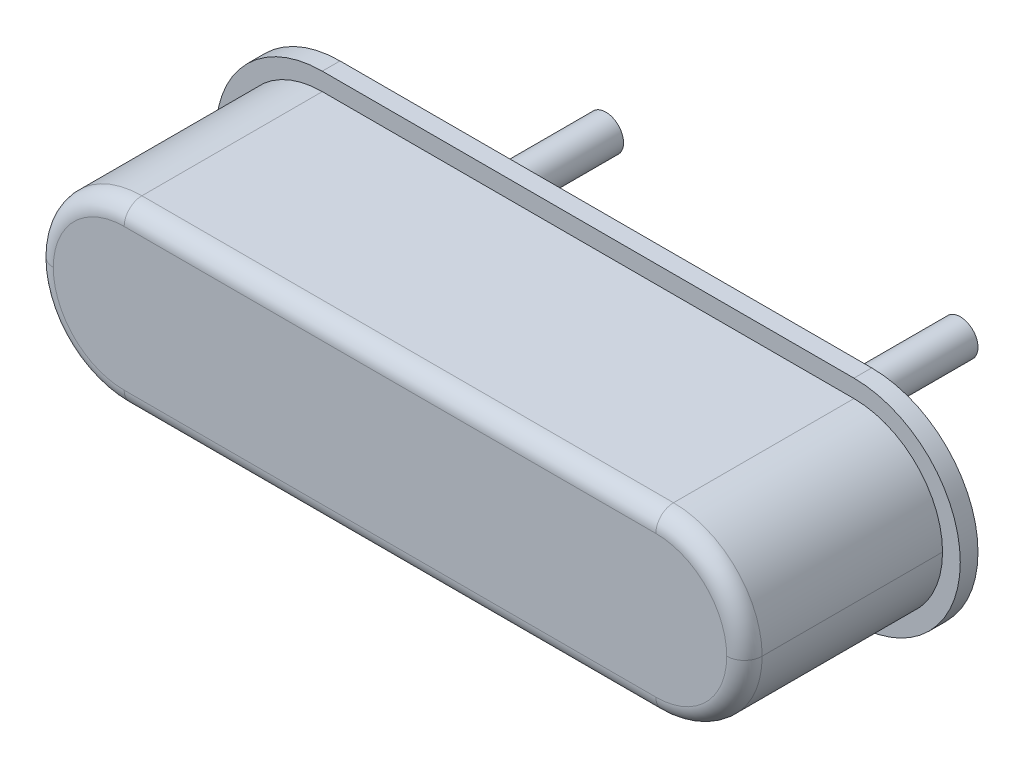
ISO-10303-21;
HEADER;
FILE_DESCRIPTION(('STEP AP214'),'2;1');
FILE_NAME('part.step','',(''),(''),'','','');
FILE_SCHEMA(('AUTOMOTIVE_DESIGN { 1 0 10303 214 1 1 1 1 }'));
ENDSEC;
DATA;
#1=APPLICATION_CONTEXT('core data for automotive mechanical design processes');
#2=APPLICATION_PROTOCOL_DEFINITION('international standard','automotive_design',2000,#1);
#3=PRODUCT_CONTEXT('',#1,'mechanical');
#4=PRODUCT('Part','Part','',(#3));
#5=PRODUCT_RELATED_PRODUCT_CATEGORY('part','',(#4));
#6=PRODUCT_DEFINITION_FORMATION('','',#4);
#7=PRODUCT_DEFINITION_CONTEXT('part definition',#1,'design');
#8=PRODUCT_DEFINITION('design','',#6,#7);
#9=PRODUCT_DEFINITION_SHAPE('','',#8);
#10=(LENGTH_UNIT() NAMED_UNIT(*) SI_UNIT(.MILLI.,.METRE.));
#11=(NAMED_UNIT(*) PLANE_ANGLE_UNIT() SI_UNIT($,.RADIAN.));
#12=(NAMED_UNIT(*) SI_UNIT($,.STERADIAN.) SOLID_ANGLE_UNIT());
#13=UNCERTAINTY_MEASURE_WITH_UNIT(LENGTH_MEASURE(1.E-05),#10,'distance_accuracy_value','');
#14=(GEOMETRIC_REPRESENTATION_CONTEXT(3) GLOBAL_UNCERTAINTY_ASSIGNED_CONTEXT((#13)) GLOBAL_UNIT_ASSIGNED_CONTEXT((#10,
#11,#12)) REPRESENTATION_CONTEXT('',''));
#15=CARTESIAN_POINT('',(0.,0.,0.));
#16=DIRECTION('',(0.,0.,1.));
#17=DIRECTION('',(1.,0.,0.));
#18=AXIS2_PLACEMENT_3D('',#15,#16,#17);
#19=CARTESIAN_POINT('',(-2.54,1.27,0.));
#20=DIRECTION('',(0.,1.,0.));
#21=DIRECTION('',(0.,0.,1.));
#22=AXIS2_PLACEMENT_3D('',#19,#20,#21);
#23=PLANE('',#22);
#24=DIRECTION('',(0.,0.,-1.));
#25=VECTOR('',#24,1.);
#26=CARTESIAN_POINT('',(6.35,1.27,0.));
#27=LINE('',#26,#25);
#28=CARTESIAN_POINT('',(6.35,1.27,2.83961477877701));
#29=VERTEX_POINT('',#28);
#30=CARTESIAN_POINT('',(6.35,1.27,0.254));
#31=VERTEX_POINT('',#30);
#32=EDGE_CURVE('E206',#29,#31,#27,.T.);
#33=ORIENTED_EDGE('',*,*,#32,.T.);
#34=DIRECTION('',(-1.,0.,0.));
#35=VECTOR('',#34,1.);
#36=CARTESIAN_POINT('',(-2.54,1.27,0.254));
#37=LINE('',#36,#35);
#38=CARTESIAN_POINT('',(-1.27,1.27,0.254));
#39=VERTEX_POINT('',#38);
#40=EDGE_CURVE('E178',#31,#39,#37,.T.);
#41=ORIENTED_EDGE('',*,*,#40,.T.);
#42=DIRECTION('',(0.,0.,1.));
#43=VECTOR('',#42,1.);
#44=CARTESIAN_POINT('',(-1.27,1.27,3.09361477877701));
#45=LINE('',#44,#43);
#46=CARTESIAN_POINT('',(-1.27,1.27,2.83961477877701));
#47=VERTEX_POINT('',#46);
#48=EDGE_CURVE('E209',#39,#47,#45,.T.);
#49=ORIENTED_EDGE('',*,*,#48,.T.);
#50=DIRECTION('',(-1.,0.,0.));
#51=VECTOR('',#50,1.);
#52=CARTESIAN_POINT('',(-2.54,1.27,2.83961477877701));
#53=LINE('',#52,#51);
#54=EDGE_CURVE('E228',#47,#29,#53,.F.);
#55=ORIENTED_EDGE('',*,*,#54,.T.);
#56=EDGE_LOOP('',(#33,#41,#49,#55));
#57=FACE_BOUND('',#56,.T.);
#58=ADVANCED_FACE('F37',(#57),#23,.T.);
#59=CARTESIAN_POINT('',(-2.54,-1.27,0.));
#60=DIRECTION('',(0.,1.,0.));
#61=DIRECTION('',(0.,0.,1.));
#62=AXIS2_PLACEMENT_3D('',#59,#60,#61);
#63=PLANE('',#62);
#64=DIRECTION('',(-1.,0.,0.));
#65=VECTOR('',#64,1.);
#66=CARTESIAN_POINT('',(-2.54,-1.27,0.254));
#67=LINE('',#66,#65);
#68=CARTESIAN_POINT('',(6.35,-1.27,0.254));
#69=VERTEX_POINT('',#68);
#70=CARTESIAN_POINT('',(-1.27,-1.27,0.254));
#71=VERTEX_POINT('',#70);
#72=EDGE_CURVE('E176',#69,#71,#67,.T.);
#73=ORIENTED_EDGE('',*,*,#72,.F.);
#74=DIRECTION('',(0.,0.,-1.));
#75=VECTOR('',#74,1.);
#76=CARTESIAN_POINT('',(6.35,-1.27,0.));
#77=LINE('',#76,#75);
#78=CARTESIAN_POINT('',(6.35,-1.27,2.83961477877701));
#79=VERTEX_POINT('',#78);
#80=EDGE_CURVE('E197',#69,#79,#77,.F.);
#81=ORIENTED_EDGE('',*,*,#80,.T.);
#82=DIRECTION('',(-1.,0.,0.));
#83=VECTOR('',#82,1.);
#84=CARTESIAN_POINT('',(-1.27,-1.27,2.83961477877701));
#85=LINE('',#84,#83);
#86=CARTESIAN_POINT('',(-1.27,-1.27,2.83961477877701));
#87=VERTEX_POINT('',#86);
#88=EDGE_CURVE('E237',#79,#87,#85,.T.);
#89=ORIENTED_EDGE('',*,*,#88,.T.);
#90=DIRECTION('',(0.,0.,1.));
#91=VECTOR('',#90,1.);
#92=CARTESIAN_POINT('',(-1.27,-1.27,0.));
#93=LINE('',#92,#91);
#94=EDGE_CURVE('E203',#87,#71,#93,.F.);
#95=ORIENTED_EDGE('',*,*,#94,.T.);
#96=EDGE_LOOP('',(#73,#81,#89,#95));
#97=FACE_BOUND('',#96,.T.);
#98=ADVANCED_FACE('F266',(#97),#63,.F.);
#99=CARTESIAN_POINT('',(-1.27,0.,0.));
#100=DIRECTION('',(0.,0.,-1.));
#101=DIRECTION('',(-1.,0.,0.));
#102=AXIS2_PLACEMENT_3D('',#99,#100,#101);
#103=CYLINDRICAL_SURFACE('',#102,1.27);
#104=ORIENTED_EDGE('',*,*,#48,.F.);
#105=CARTESIAN_POINT('',(-1.27,0.,0.254));
#106=DIRECTION('',(0.,0.,-1.));
#107=DIRECTION('',(-1.,0.,0.));
#108=AXIS2_PLACEMENT_3D('',#105,#106,#107);
#109=CIRCLE('',#108,1.27);
#110=CARTESIAN_POINT('',(-2.54,0.,0.254));
#111=VERTEX_POINT('',#110);
#112=EDGE_CURVE('E184',#39,#111,#109,.F.);
#113=ORIENTED_EDGE('',*,*,#112,.T.);
#114=DIRECTION('',(0.,0.,1.));
#115=VECTOR('',#114,1.);
#116=CARTESIAN_POINT('',(-2.54,0.,0.));
#117=LINE('',#116,#115);
#118=CARTESIAN_POINT('',(-2.54,0.,2.83961477877701));
#119=VERTEX_POINT('',#118);
#120=EDGE_CURVE('E201',#119,#111,#117,.F.);
#121=ORIENTED_EDGE('',*,*,#120,.F.);
#122=CARTESIAN_POINT('',(-1.27,0.,2.83961477877701));
#123=DIRECTION('',(0.,0.,1.));
#124=DIRECTION('',(1.,0.,0.));
#125=AXIS2_PLACEMENT_3D('',#122,#123,#124);
#126=CIRCLE('',#125,1.27);
#127=EDGE_CURVE('E45',#119,#47,#126,.F.);
#128=ORIENTED_EDGE('',*,*,#127,.T.);
#129=EDGE_LOOP('',(#104,#113,#121,#128));
#130=FACE_BOUND('',#129,.T.);
#131=ADVANCED_FACE('F271',(#130),#103,.T.);
#132=CARTESIAN_POINT('',(-1.27,0.,0.));
#133=DIRECTION('',(0.,0.,1.));
#134=DIRECTION('',(1.,0.,0.));
#135=AXIS2_PLACEMENT_3D('',#132,#133,#134);
#136=CYLINDRICAL_SURFACE('',#135,1.27);
#137=ORIENTED_EDGE('',*,*,#120,.T.);
#138=CARTESIAN_POINT('',(-1.27,0.,0.254));
#139=DIRECTION('',(0.,0.,-1.));
#140=DIRECTION('',(-1.,0.,0.));
#141=AXIS2_PLACEMENT_3D('',#138,#139,#140);
#142=CIRCLE('',#141,1.27);
#143=EDGE_CURVE('E181',#111,#71,#142,.F.);
#144=ORIENTED_EDGE('',*,*,#143,.T.);
#145=ORIENTED_EDGE('',*,*,#94,.F.);
#146=CARTESIAN_POINT('',(-1.27,0.,2.83961477877701));
#147=DIRECTION('',(0.,0.,1.));
#148=DIRECTION('',(1.,0.,0.));
#149=AXIS2_PLACEMENT_3D('',#146,#147,#148);
#150=CIRCLE('',#149,1.27);
#151=EDGE_CURVE('E59',#87,#119,#150,.F.);
#152=ORIENTED_EDGE('',*,*,#151,.T.);
#153=EDGE_LOOP('',(#137,#144,#145,#152));
#154=FACE_BOUND('',#153,.T.);
#155=ADVANCED_FACE('F268',(#154),#136,.T.);
#156=CARTESIAN_POINT('',(6.35,0.,0.));
#157=DIRECTION('',(0.,0.,1.));
#158=DIRECTION('',(1.,0.,0.));
#159=AXIS2_PLACEMENT_3D('',#156,#157,#158);
#160=CYLINDRICAL_SURFACE('',#159,1.27);
#161=DIRECTION('',(0.,0.,-1.));
#162=VECTOR('',#161,1.);
#163=CARTESIAN_POINT('',(7.62,0.,3.09361477877701));
#164=LINE('',#163,#162);
#165=CARTESIAN_POINT('',(7.62,0.,0.254));
#166=VERTEX_POINT('',#165);
#167=CARTESIAN_POINT('',(7.62,0.,2.83961477877701));
#168=VERTEX_POINT('',#167);
#169=EDGE_CURVE('E213',#166,#168,#164,.F.);
#170=ORIENTED_EDGE('',*,*,#169,.F.);
#171=CARTESIAN_POINT('',(6.35,0.,0.254));
#172=DIRECTION('',(0.,0.,-1.));
#173=DIRECTION('',(-1.,0.,0.));
#174=AXIS2_PLACEMENT_3D('',#171,#172,#173);
#175=CIRCLE('',#174,1.27);
#176=EDGE_CURVE('E52',#166,#31,#175,.F.);
#177=ORIENTED_EDGE('',*,*,#176,.T.);
#178=ORIENTED_EDGE('',*,*,#32,.F.);
#179=CARTESIAN_POINT('',(6.35,0.,2.83961477877701));
#180=DIRECTION('',(0.,0.,1.));
#181=DIRECTION('',(1.,0.,0.));
#182=AXIS2_PLACEMENT_3D('',#179,#180,#181);
#183=CIRCLE('',#182,1.27);
#184=EDGE_CURVE('E231',#29,#168,#183,.F.);
#185=ORIENTED_EDGE('',*,*,#184,.T.);
#186=EDGE_LOOP('',(#170,#177,#178,#185));
#187=FACE_BOUND('',#186,.T.);
#188=ADVANCED_FACE('F279',(#187),#160,.T.);
#189=CARTESIAN_POINT('',(6.35,0.,3.09361477877701));
#190=DIRECTION('',(0.,0.,-1.));
#191=DIRECTION('',(-1.,0.,0.));
#192=AXIS2_PLACEMENT_3D('',#189,#190,#191);
#193=CYLINDRICAL_SURFACE('',#192,1.27);
#194=ORIENTED_EDGE('',*,*,#80,.F.);
#195=CARTESIAN_POINT('',(6.35,0.,0.254));
#196=DIRECTION('',(0.,0.,-1.));
#197=DIRECTION('',(-1.,0.,0.));
#198=AXIS2_PLACEMENT_3D('',#195,#196,#197);
#199=CIRCLE('',#198,1.27);
#200=EDGE_CURVE('E11',#69,#166,#199,.F.);
#201=ORIENTED_EDGE('',*,*,#200,.T.);
#202=ORIENTED_EDGE('',*,*,#169,.T.);
#203=CARTESIAN_POINT('',(6.35,0.,2.83961477877701));
#204=DIRECTION('',(0.,0.,1.));
#205=DIRECTION('',(1.,0.,0.));
#206=AXIS2_PLACEMENT_3D('',#203,#204,#205);
#207=CIRCLE('',#206,1.27);
#208=EDGE_CURVE('E234',#168,#79,#207,.F.);
#209=ORIENTED_EDGE('',*,*,#208,.T.);
#210=EDGE_LOOP('',(#194,#201,#202,#209));
#211=FACE_BOUND('',#210,.T.);
#212=ADVANCED_FACE('F282',(#211),#193,.T.);
#213=CARTESIAN_POINT('',(7.62,1.27,3.09361477877701));
#214=DIRECTION('',(0.,0.,1.));
#215=DIRECTION('',(1.,0.,0.));
#216=AXIS2_PLACEMENT_3D('',#213,#214,#215);
#217=PLANE('',#216);
#218=CARTESIAN_POINT('',(6.35,0.,3.09361477877701));
#219=DIRECTION('',(0.,0.,1.));
#220=DIRECTION('',(1.,0.,0.));
#221=AXIS2_PLACEMENT_3D('',#218,#219,#220);
#222=CIRCLE('',#221,1.016);
#223=CARTESIAN_POINT('',(7.366,0.,3.09361477877701));
#224=VERTEX_POINT('',#223);
#225=CARTESIAN_POINT('',(6.35,1.016,3.09361477877701));
#226=VERTEX_POINT('',#225);
#227=EDGE_CURVE('E223',#224,#226,#222,.T.);
#228=ORIENTED_EDGE('',*,*,#227,.T.);
#229=DIRECTION('',(-1.,0.,0.));
#230=VECTOR('',#229,1.);
#231=CARTESIAN_POINT('',(7.62,1.016,3.09361477877701));
#232=LINE('',#231,#230);
#233=CARTESIAN_POINT('',(-1.27,1.016,3.09361477877701));
#234=VERTEX_POINT('',#233);
#235=EDGE_CURVE('E225',#226,#234,#232,.T.);
#236=ORIENTED_EDGE('',*,*,#235,.T.);
#237=CARTESIAN_POINT('',(-1.27,0.,3.09361477877701));
#238=DIRECTION('',(0.,0.,1.));
#239=DIRECTION('',(1.,0.,0.));
#240=AXIS2_PLACEMENT_3D('',#237,#238,#239);
#241=CIRCLE('',#240,1.016);
#242=CARTESIAN_POINT('',(-2.286,0.,3.09361477877701));
#243=VERTEX_POINT('',#242);
#244=EDGE_CURVE('E211',#234,#243,#241,.T.);
#245=ORIENTED_EDGE('',*,*,#244,.T.);
#246=CARTESIAN_POINT('',(-1.27,0.,3.09361477877701));
#247=DIRECTION('',(0.,0.,1.));
#248=DIRECTION('',(1.,0.,0.));
#249=AXIS2_PLACEMENT_3D('',#246,#247,#248);
#250=CIRCLE('',#249,1.016);
#251=CARTESIAN_POINT('',(-1.27,-1.016,3.09361477877701));
#252=VERTEX_POINT('',#251);
#253=EDGE_CURVE('E217',#243,#252,#250,.T.);
#254=ORIENTED_EDGE('',*,*,#253,.T.);
#255=DIRECTION('',(-1.,0.,0.));
#256=VECTOR('',#255,1.);
#257=CARTESIAN_POINT('',(6.35,-1.016,3.09361477877701));
#258=LINE('',#257,#256);
#259=CARTESIAN_POINT('',(6.35,-1.016,3.09361477877701));
#260=VERTEX_POINT('',#259);
#261=EDGE_CURVE('E219',#252,#260,#258,.F.);
#262=ORIENTED_EDGE('',*,*,#261,.T.);
#263=CARTESIAN_POINT('',(6.35,0.,3.09361477877701));
#264=DIRECTION('',(0.,0.,1.));
#265=DIRECTION('',(1.,0.,0.));
#266=AXIS2_PLACEMENT_3D('',#263,#264,#265);
#267=CIRCLE('',#266,1.016);
#268=EDGE_CURVE('E221',#260,#224,#267,.T.);
#269=ORIENTED_EDGE('',*,*,#268,.T.);
#270=EDGE_LOOP('',(#228,#236,#245,#254,#262,#269));
#271=FACE_BOUND('',#270,.T.);
#272=ADVANCED_FACE('F284',(#271),#217,.T.);
#273=CARTESIAN_POINT('',(-2.54,-1.016,2.83961477877701));
#274=DIRECTION('',(1.,0.,0.));
#275=DIRECTION('',(0.,0.,-1.));
#276=AXIS2_PLACEMENT_3D('',#273,#274,#275);
#277=CYLINDRICAL_SURFACE('',#276,0.254);
#278=CARTESIAN_POINT('',(-1.27,-1.016,2.83961477877701));
#279=DIRECTION('',(-1.,0.,0.));
#280=DIRECTION('',(0.,0.,1.));
#281=AXIS2_PLACEMENT_3D('',#278,#279,#280);
#282=CIRCLE('',#281,0.254);
#283=EDGE_CURVE('E251',#87,#252,#282,.T.);
#284=ORIENTED_EDGE('',*,*,#283,.F.);
#285=ORIENTED_EDGE('',*,*,#88,.F.);
#286=CARTESIAN_POINT('',(6.35,-1.016,2.83961477877701));
#287=DIRECTION('',(1.,0.,0.));
#288=DIRECTION('',(0.,0.,-1.));
#289=AXIS2_PLACEMENT_3D('',#286,#287,#288);
#290=CIRCLE('',#289,0.254);
#291=EDGE_CURVE('E215',#260,#79,#290,.T.);
#292=ORIENTED_EDGE('',*,*,#291,.F.);
#293=ORIENTED_EDGE('',*,*,#261,.F.);
#294=EDGE_LOOP('',(#284,#285,#292,#293));
#295=FACE_BOUND('',#294,.T.);
#296=ADVANCED_FACE('F39',(#295),#277,.T.);
#297=CARTESIAN_POINT('',(6.35,0.,2.83961477877701));
#298=DIRECTION('',(0.,0.,1.));
#299=DIRECTION('',(1.,0.,0.));
#300=AXIS2_PLACEMENT_3D('',#297,#298,#299);
#301=TOROIDAL_SURFACE('',#300,1.016,0.254);
#302=ORIENTED_EDGE('',*,*,#291,.T.);
#303=ORIENTED_EDGE('',*,*,#208,.F.);
#304=CARTESIAN_POINT('',(7.366,0.,2.83961477877701));
#305=DIRECTION('',(0.,1.,0.));
#306=DIRECTION('',(0.,0.,1.));
#307=AXIS2_PLACEMENT_3D('',#304,#305,#306);
#308=CIRCLE('',#307,0.254);
#309=EDGE_CURVE('E248',#224,#168,#308,.T.);
#310=ORIENTED_EDGE('',*,*,#309,.F.);
#311=ORIENTED_EDGE('',*,*,#268,.F.);
#312=EDGE_LOOP('',(#302,#303,#310,#311));
#313=FACE_BOUND('',#312,.T.);
#314=ADVANCED_FACE('F258',(#313),#301,.T.);
#315=CARTESIAN_POINT('',(-1.27,0.,2.83961477877701));
#316=DIRECTION('',(0.,0.,1.));
#317=DIRECTION('',(1.,0.,0.));
#318=AXIS2_PLACEMENT_3D('',#315,#316,#317);
#319=TOROIDAL_SURFACE('',#318,1.016,0.254);
#320=ORIENTED_EDGE('',*,*,#283,.T.);
#321=ORIENTED_EDGE('',*,*,#253,.F.);
#322=CARTESIAN_POINT('',(-2.286,0.,2.83961477877701));
#323=DIRECTION('',(0.,1.,0.));
#324=DIRECTION('',(0.,0.,1.));
#325=AXIS2_PLACEMENT_3D('',#322,#323,#324);
#326=CIRCLE('',#325,0.254);
#327=EDGE_CURVE('E245',#119,#243,#326,.T.);
#328=ORIENTED_EDGE('',*,*,#327,.F.);
#329=ORIENTED_EDGE('',*,*,#151,.F.);
#330=EDGE_LOOP('',(#320,#321,#328,#329));
#331=FACE_BOUND('',#330,.T.);
#332=ADVANCED_FACE('F341',(#331),#319,.T.);
#333=CARTESIAN_POINT('',(6.35,0.,2.83961477877701));
#334=DIRECTION('',(0.,0.,1.));
#335=DIRECTION('',(1.,0.,0.));
#336=AXIS2_PLACEMENT_3D('',#333,#334,#335);
#337=TOROIDAL_SURFACE('',#336,1.016,0.254);
#338=ORIENTED_EDGE('',*,*,#309,.T.);
#339=ORIENTED_EDGE('',*,*,#184,.F.);
#340=CARTESIAN_POINT('',(6.35,1.016,2.83961477877701));
#341=DIRECTION('',(-1.,0.,0.));
#342=DIRECTION('',(0.,0.,1.));
#343=AXIS2_PLACEMENT_3D('',#340,#341,#342);
#344=CIRCLE('',#343,0.254);
#345=EDGE_CURVE('E243',#226,#29,#344,.T.);
#346=ORIENTED_EDGE('',*,*,#345,.F.);
#347=ORIENTED_EDGE('',*,*,#227,.F.);
#348=EDGE_LOOP('',(#338,#339,#346,#347));
#349=FACE_BOUND('',#348,.T.);
#350=ADVANCED_FACE('F365',(#349),#337,.T.);
#351=CARTESIAN_POINT('',(-1.27,0.,2.83961477877701));
#352=DIRECTION('',(0.,0.,1.));
#353=DIRECTION('',(1.,0.,0.));
#354=AXIS2_PLACEMENT_3D('',#351,#352,#353);
#355=TOROIDAL_SURFACE('',#354,1.016,0.254);
#356=ORIENTED_EDGE('',*,*,#327,.T.);
#357=ORIENTED_EDGE('',*,*,#244,.F.);
#358=CARTESIAN_POINT('',(-1.27,1.016,2.83961477877701));
#359=DIRECTION('',(1.,0.,0.));
#360=DIRECTION('',(0.,0.,-1.));
#361=AXIS2_PLACEMENT_3D('',#358,#359,#360);
#362=CIRCLE('',#361,0.254);
#363=EDGE_CURVE('E193',#47,#234,#362,.T.);
#364=ORIENTED_EDGE('',*,*,#363,.F.);
#365=ORIENTED_EDGE('',*,*,#127,.F.);
#366=EDGE_LOOP('',(#356,#357,#364,#365));
#367=FACE_BOUND('',#366,.T.);
#368=ADVANCED_FACE('F370',(#367),#355,.T.);
#369=CARTESIAN_POINT('',(7.62,1.016,2.83961477877701));
#370=DIRECTION('',(-1.,0.,0.));
#371=DIRECTION('',(0.,0.,1.));
#372=AXIS2_PLACEMENT_3D('',#369,#370,#371);
#373=CYLINDRICAL_SURFACE('',#372,0.254);
#374=ORIENTED_EDGE('',*,*,#345,.T.);
#375=ORIENTED_EDGE('',*,*,#54,.F.);
#376=ORIENTED_EDGE('',*,*,#363,.T.);
#377=ORIENTED_EDGE('',*,*,#235,.F.);
#378=EDGE_LOOP('',(#374,#375,#376,#377));
#379=FACE_BOUND('',#378,.T.);
#380=ADVANCED_FACE('F377',(#379),#373,.T.);
#381=CARTESIAN_POINT('',(6.35,0.,0.254));
#382=DIRECTION('',(0.,0.,-1.));
#383=DIRECTION('',(-1.,0.,0.));
#384=AXIS2_PLACEMENT_3D('',#381,#382,#383);
#385=CYLINDRICAL_SURFACE('',#384,1.524);
#386=CARTESIAN_POINT('',(6.35,0.,0.));
#387=DIRECTION('',(0.,0.,-1.));
#388=DIRECTION('',(-1.,0.,0.));
#389=AXIS2_PLACEMENT_3D('',#386,#387,#388);
#390=CIRCLE('',#389,1.524);
#391=CARTESIAN_POINT('',(6.35,1.524,0.));
#392=VERTEX_POINT('',#391);
#393=CARTESIAN_POINT('',(6.35,-1.524,0.));
#394=VERTEX_POINT('',#393);
#395=EDGE_CURVE('E158',#392,#394,#390,.T.);
#396=ORIENTED_EDGE('',*,*,#395,.F.);
#397=DIRECTION('',(0.,0.,-1.));
#398=VECTOR('',#397,1.);
#399=CARTESIAN_POINT('',(6.35,1.524,0.254));
#400=LINE('',#399,#398);
#401=CARTESIAN_POINT('',(6.35,1.524,0.254));
#402=VERTEX_POINT('',#401);
#403=EDGE_CURVE('E156',#402,#392,#400,.T.);
#404=ORIENTED_EDGE('',*,*,#403,.F.);
#405=CARTESIAN_POINT('',(6.35,0.,0.254));
#406=DIRECTION('',(0.,0.,-1.));
#407=DIRECTION('',(-1.,0.,0.));
#408=AXIS2_PLACEMENT_3D('',#405,#406,#407);
#409=CIRCLE('',#408,1.524);
#410=CARTESIAN_POINT('',(6.35,-1.524,0.254));
#411=VERTEX_POINT('',#410);
#412=EDGE_CURVE('E151',#402,#411,#409,.T.);
#413=ORIENTED_EDGE('',*,*,#412,.T.);
#414=DIRECTION('',(0.,0.,-1.));
#415=VECTOR('',#414,1.);
#416=CARTESIAN_POINT('',(6.35,-1.524,0.254));
#417=LINE('',#416,#415);
#418=EDGE_CURVE('E134',#411,#394,#417,.T.);
#419=ORIENTED_EDGE('',*,*,#418,.T.);
#420=EDGE_LOOP('',(#396,#404,#413,#419));
#421=FACE_BOUND('',#420,.T.);
#422=ADVANCED_FACE('F155',(#421),#385,.T.);
#423=CARTESIAN_POINT('',(-1.27,1.524,0.254));
#424=DIRECTION('',(0.,1.,0.));
#425=DIRECTION('',(0.,0.,1.));
#426=AXIS2_PLACEMENT_3D('',#423,#424,#425);
#427=PLANE('',#426);
#428=DIRECTION('',(1.,0.,0.));
#429=VECTOR('',#428,1.);
#430=CARTESIAN_POINT('',(-1.27,1.524,0.));
#431=LINE('',#430,#429);
#432=CARTESIAN_POINT('',(-1.27,1.524,0.));
#433=VERTEX_POINT('',#432);
#434=EDGE_CURVE('E160',#433,#392,#431,.T.);
#435=ORIENTED_EDGE('',*,*,#434,.F.);
#436=DIRECTION('',(0.,0.,-1.));
#437=VECTOR('',#436,1.);
#438=CARTESIAN_POINT('',(-1.27,1.524,0.254));
#439=LINE('',#438,#437);
#440=CARTESIAN_POINT('',(-1.27,1.524,0.254));
#441=VERTEX_POINT('',#440);
#442=EDGE_CURVE('E172',#441,#433,#439,.T.);
#443=ORIENTED_EDGE('',*,*,#442,.F.);
#444=DIRECTION('',(1.,0.,0.));
#445=VECTOR('',#444,1.);
#446=CARTESIAN_POINT('',(-1.27,1.524,0.254));
#447=LINE('',#446,#445);
#448=EDGE_CURVE('E145',#441,#402,#447,.T.);
#449=ORIENTED_EDGE('',*,*,#448,.T.);
#450=ORIENTED_EDGE('',*,*,#403,.T.);
#451=EDGE_LOOP('',(#435,#443,#449,#450));
#452=FACE_BOUND('',#451,.T.);
#453=ADVANCED_FACE('F392',(#452),#427,.T.);
#454=CARTESIAN_POINT('',(-1.27,0.,0.254));
#455=DIRECTION('',(0.,0.,-1.));
#456=DIRECTION('',(-1.,0.,0.));
#457=AXIS2_PLACEMENT_3D('',#454,#455,#456);
#458=CYLINDRICAL_SURFACE('',#457,1.524);
#459=CARTESIAN_POINT('',(-1.27,0.,0.));
#460=DIRECTION('',(0.,0.,-1.));
#461=DIRECTION('',(-1.,0.,0.));
#462=AXIS2_PLACEMENT_3D('',#459,#460,#461);
#463=CIRCLE('',#462,1.524);
#464=CARTESIAN_POINT('',(-1.27,-1.524,0.));
#465=VERTEX_POINT('',#464);
#466=EDGE_CURVE('E166',#465,#433,#463,.T.);
#467=ORIENTED_EDGE('',*,*,#466,.F.);
#468=DIRECTION('',(0.,0.,-1.));
#469=VECTOR('',#468,1.);
#470=CARTESIAN_POINT('',(-1.27,-1.524,0.254));
#471=LINE('',#470,#469);
#472=CARTESIAN_POINT('',(-1.27,-1.524,0.254));
#473=VERTEX_POINT('',#472);
#474=EDGE_CURVE('E144',#473,#465,#471,.T.);
#475=ORIENTED_EDGE('',*,*,#474,.F.);
#476=CARTESIAN_POINT('',(-1.27,0.,0.254));
#477=DIRECTION('',(0.,0.,-1.));
#478=DIRECTION('',(-1.,0.,0.));
#479=AXIS2_PLACEMENT_3D('',#476,#477,#478);
#480=CIRCLE('',#479,1.524);
#481=EDGE_CURVE('E153',#473,#441,#480,.T.);
#482=ORIENTED_EDGE('',*,*,#481,.T.);
#483=ORIENTED_EDGE('',*,*,#442,.T.);
#484=EDGE_LOOP('',(#467,#475,#482,#483));
#485=FACE_BOUND('',#484,.T.);
#486=ADVANCED_FACE('F398',(#485),#458,.T.);
#487=CARTESIAN_POINT('',(6.35,-1.524,0.254));
#488=DIRECTION('',(0.,-1.,0.));
#489=DIRECTION('',(0.,0.,-1.));
#490=AXIS2_PLACEMENT_3D('',#487,#488,#489);
#491=PLANE('',#490);
#492=DIRECTION('',(-1.,0.,0.));
#493=VECTOR('',#492,1.);
#494=CARTESIAN_POINT('',(6.35,-1.524,0.));
#495=LINE('',#494,#493);
#496=EDGE_CURVE('E140',#394,#465,#495,.T.);
#497=ORIENTED_EDGE('',*,*,#496,.F.);
#498=ORIENTED_EDGE('',*,*,#418,.F.);
#499=DIRECTION('',(-1.,0.,0.));
#500=VECTOR('',#499,1.);
#501=CARTESIAN_POINT('',(6.35,-1.524,0.254));
#502=LINE('',#501,#500);
#503=EDGE_CURVE('E138',#411,#473,#502,.T.);
#504=ORIENTED_EDGE('',*,*,#503,.T.);
#505=ORIENTED_EDGE('',*,*,#474,.T.);
#506=EDGE_LOOP('',(#497,#498,#504,#505));
#507=FACE_BOUND('',#506,.T.);
#508=ADVANCED_FACE('F136',(#507),#491,.T.);
#509=CARTESIAN_POINT('',(6.35,0.,0.254));
#510=DIRECTION('',(0.,0.,-1.));
#511=DIRECTION('',(-1.,0.,0.));
#512=AXIS2_PLACEMENT_3D('',#509,#510,#511);
#513=PLANE('',#512);
#514=ORIENTED_EDGE('',*,*,#112,.F.);
#515=ORIENTED_EDGE('',*,*,#40,.F.);
#516=ORIENTED_EDGE('',*,*,#176,.F.);
#517=ORIENTED_EDGE('',*,*,#200,.F.);
#518=ORIENTED_EDGE('',*,*,#72,.T.);
#519=ORIENTED_EDGE('',*,*,#143,.F.);
#520=EDGE_LOOP('',(#514,#515,#516,#517,#518,#519));
#521=FACE_BOUND('',#520,.T.);
#522=ORIENTED_EDGE('',*,*,#412,.F.);
#523=ORIENTED_EDGE('',*,*,#448,.F.);
#524=ORIENTED_EDGE('',*,*,#481,.F.);
#525=ORIENTED_EDGE('',*,*,#503,.F.);
#526=EDGE_LOOP('',(#522,#523,#524,#525));
#527=FACE_BOUND('',#526,.T.);
#528=ADVANCED_FACE('F149',(#521,#527),#513,.F.);
#529=CARTESIAN_POINT('',(5.08,0.,-2.54));
#530=DIRECTION('',(0.,0.,1.));
#531=DIRECTION('',(-1.,0.,0.));
#532=AXIS2_PLACEMENT_3D('',#529,#530,#531);
#533=PLANE('',#532);
#534=CARTESIAN_POINT('',(5.08,0.,-2.54));
#535=DIRECTION('',(0.,0.,-1.));
#536=DIRECTION('',(-1.,0.,0.));
#537=AXIS2_PLACEMENT_3D('',#534,#535,#536);
#538=CIRCLE('',#537,0.254);
#539=CARTESIAN_POINT('',(4.826,0.,-2.54));
#540=VERTEX_POINT('',#539);
#541=EDGE_CURVE('E190',#540,#540,#538,.T.);
#542=ORIENTED_EDGE('',*,*,#541,.T.);
#543=EDGE_LOOP('',(#542));
#544=FACE_BOUND('',#543,.T.);
#545=ADVANCED_FACE('F312',(#544),#533,.F.);
#546=CARTESIAN_POINT('',(0.,0.,-2.54));
#547=DIRECTION('',(0.,0.,1.));
#548=DIRECTION('',(1.,0.,0.));
#549=AXIS2_PLACEMENT_3D('',#546,#547,#548);
#550=PLANE('',#549);
#551=CARTESIAN_POINT('',(0.,0.,-2.54));
#552=DIRECTION('',(0.,0.,1.));
#553=DIRECTION('',(1.,0.,0.));
#554=AXIS2_PLACEMENT_3D('',#551,#552,#553);
#555=CIRCLE('',#554,0.254);
#556=CARTESIAN_POINT('',(0.254,0.,-2.54));
#557=VERTEX_POINT('',#556);
#558=EDGE_CURVE('E194',#557,#557,#555,.T.);
#559=ORIENTED_EDGE('',*,*,#558,.F.);
#560=EDGE_LOOP('',(#559));
#561=FACE_BOUND('',#560,.T.);
#562=ADVANCED_FACE('F309',(#561),#550,.F.);
#563=CARTESIAN_POINT('',(5.08,0.,0.508));
#564=DIRECTION('',(0.,0.,-1.));
#565=DIRECTION('',(1.,0.,0.));
#566=AXIS2_PLACEMENT_3D('',#563,#564,#565);
#567=CYLINDRICAL_SURFACE('',#566,0.254);
#568=CARTESIAN_POINT('',(5.08,0.,0.));
#569=DIRECTION('',(0.,0.,1.));
#570=DIRECTION('',(1.,0.,0.));
#571=AXIS2_PLACEMENT_3D('',#568,#569,#570);
#572=CIRCLE('',#571,0.254);
#573=CARTESIAN_POINT('',(5.334,0.,0.));
#574=VERTEX_POINT('',#573);
#575=EDGE_CURVE('E187',#574,#574,#572,.T.);
#576=ORIENTED_EDGE('',*,*,#575,.F.);
#577=EDGE_LOOP('',(#576));
#578=FACE_BOUND('',#577,.T.);
#579=ORIENTED_EDGE('',*,*,#541,.F.);
#580=EDGE_LOOP('',(#579));
#581=FACE_BOUND('',#580,.T.);
#582=ADVANCED_FACE('F301',(#578,#581),#567,.T.);
#583=CARTESIAN_POINT('',(0.,0.,0.508));
#584=DIRECTION('',(0.,0.,-1.));
#585=DIRECTION('',(-1.,0.,0.));
#586=AXIS2_PLACEMENT_3D('',#583,#584,#585);
#587=CYLINDRICAL_SURFACE('',#586,0.254);
#588=CARTESIAN_POINT('',(0.,0.,0.));
#589=DIRECTION('',(0.,0.,-1.));
#590=DIRECTION('',(-1.,0.,0.));
#591=AXIS2_PLACEMENT_3D('',#588,#589,#590);
#592=CIRCLE('',#591,0.254);
#593=CARTESIAN_POINT('',(-0.254,0.,0.));
#594=VERTEX_POINT('',#593);
#595=EDGE_CURVE('E198',#594,#594,#592,.T.);
#596=ORIENTED_EDGE('',*,*,#595,.T.);
#597=EDGE_LOOP('',(#596));
#598=FACE_BOUND('',#597,.T.);
#599=ORIENTED_EDGE('',*,*,#558,.T.);
#600=EDGE_LOOP('',(#599));
#601=FACE_BOUND('',#600,.T.);
#602=ADVANCED_FACE('F306',(#598,#601),#587,.T.);
#603=CARTESIAN_POINT('',(-2.54,1.27,0.));
#604=DIRECTION('',(0.,0.,-1.));
#605=DIRECTION('',(-1.,0.,0.));
#606=AXIS2_PLACEMENT_3D('',#603,#604,#605);
#607=PLANE('',#606);
#608=ORIENTED_EDGE('',*,*,#595,.F.);
#609=EDGE_LOOP('',(#608));
#610=FACE_BOUND('',#609,.T.);
#611=ORIENTED_EDGE('',*,*,#575,.T.);
#612=EDGE_LOOP('',(#611));
#613=FACE_BOUND('',#612,.T.);
#614=ORIENTED_EDGE('',*,*,#395,.T.);
#615=ORIENTED_EDGE('',*,*,#496,.T.);
#616=ORIENTED_EDGE('',*,*,#466,.T.);
#617=ORIENTED_EDGE('',*,*,#434,.T.);
#618=EDGE_LOOP('',(#614,#615,#616,#617));
#619=FACE_BOUND('',#618,.T.);
#620=ADVANCED_FACE('F304',(#610,#613,#619),#607,.T.);
#621=CLOSED_SHELL('',(#58,#98,#131,#155,#188,#212,#272,#296,#314,#332,#350,#368,#380,#422,#453,
#486,#508,#528,#545,#562,#582,#602,#620));
#622=MANIFOLD_SOLID_BREP('B2',#621);
#623=ADVANCED_BREP_SHAPE_REPRESENTATION('',(#18,#622),#14);
#624=SHAPE_DEFINITION_REPRESENTATION(#9,#623);
ENDSEC;
END-ISO-10303-21;
